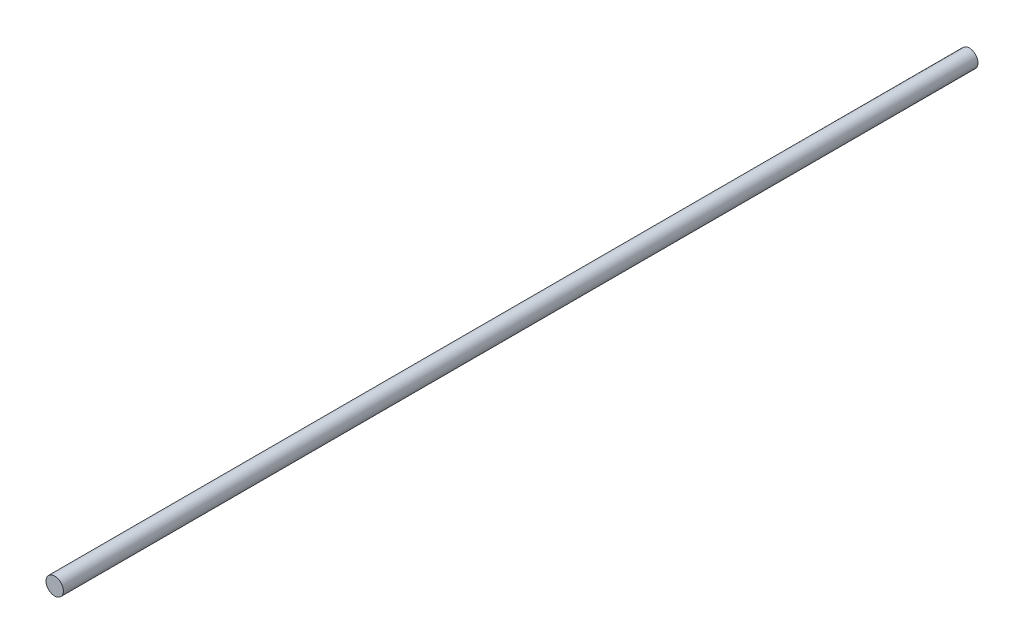
ISO-10303-21;
HEADER;
FILE_DESCRIPTION(('STEP AP214'),'2;1');
FILE_NAME('part.step','',(''),(''),'','','');
FILE_SCHEMA(('AUTOMOTIVE_DESIGN { 1 0 10303 214 1 1 1 1 }'));
ENDSEC;
DATA;
#1=APPLICATION_CONTEXT('core data for automotive mechanical design processes');
#2=APPLICATION_PROTOCOL_DEFINITION('international standard','automotive_design',2000,#1);
#3=PRODUCT_CONTEXT('',#1,'mechanical');
#4=PRODUCT('Part','Part','',(#3));
#5=PRODUCT_RELATED_PRODUCT_CATEGORY('part','',(#4));
#6=PRODUCT_DEFINITION_FORMATION('','',#4);
#7=PRODUCT_DEFINITION_CONTEXT('part definition',#1,'design');
#8=PRODUCT_DEFINITION('design','',#6,#7);
#9=PRODUCT_DEFINITION_SHAPE('','',#8);
#10=(LENGTH_UNIT() NAMED_UNIT(*) SI_UNIT(.MILLI.,.METRE.));
#11=(NAMED_UNIT(*) PLANE_ANGLE_UNIT() SI_UNIT($,.RADIAN.));
#12=(NAMED_UNIT(*) SI_UNIT($,.STERADIAN.) SOLID_ANGLE_UNIT());
#13=UNCERTAINTY_MEASURE_WITH_UNIT(LENGTH_MEASURE(1.E-05),#10,'distance_accuracy_value','');
#14=(GEOMETRIC_REPRESENTATION_CONTEXT(3) GLOBAL_UNCERTAINTY_ASSIGNED_CONTEXT((#13)) GLOBAL_UNIT_ASSIGNED_CONTEXT((#10,
#11,#12)) REPRESENTATION_CONTEXT('',''));
#15=CARTESIAN_POINT('',(0.,0.,0.));
#16=DIRECTION('',(0.,0.,1.));
#17=DIRECTION('',(1.,0.,0.));
#18=AXIS2_PLACEMENT_3D('',#15,#16,#17);
#19=CARTESIAN_POINT('',(0.,0.,200.));
#20=DIRECTION('',(0.,0.,-1.));
#21=DIRECTION('',(-1.,0.,0.));
#22=AXIS2_PLACEMENT_3D('',#19,#20,#21);
#23=CYLINDRICAL_SURFACE('',#22,1.9);
#24=CARTESIAN_POINT('',(0.,0.,200.));
#25=DIRECTION('',(0.,0.,1.));
#26=DIRECTION('',(1.,0.,0.));
#27=AXIS2_PLACEMENT_3D('',#24,#25,#26);
#28=CIRCLE('',#27,1.9);
#29=CARTESIAN_POINT('',(1.9,0.,200.));
#30=VERTEX_POINT('',#29);
#31=EDGE_CURVE('E10',#30,#30,#28,.T.);
#32=ORIENTED_EDGE('',*,*,#31,.F.);
#33=EDGE_LOOP('',(#32));
#34=FACE_BOUND('',#33,.T.);
#35=CARTESIAN_POINT('',(0.,0.,0.));
#36=DIRECTION('',(0.,0.,1.));
#37=DIRECTION('',(1.,0.,0.));
#38=AXIS2_PLACEMENT_3D('',#35,#36,#37);
#39=CIRCLE('',#38,1.9);
#40=CARTESIAN_POINT('',(1.9,0.,0.));
#41=VERTEX_POINT('',#40);
#42=EDGE_CURVE('E40',#41,#41,#39,.T.);
#43=ORIENTED_EDGE('',*,*,#42,.T.);
#44=EDGE_LOOP('',(#43));
#45=FACE_BOUND('',#44,.T.);
#46=ADVANCED_FACE('F37',(#34,#45),#23,.T.);
#47=CARTESIAN_POINT('',(0.,0.,200.));
#48=DIRECTION('',(0.,0.,1.));
#49=DIRECTION('',(1.,0.,0.));
#50=AXIS2_PLACEMENT_3D('',#47,#48,#49);
#51=PLANE('',#50);
#52=ORIENTED_EDGE('',*,*,#31,.T.);
#53=EDGE_LOOP('',(#52));
#54=FACE_BOUND('',#53,.T.);
#55=ADVANCED_FACE('F54',(#54),#51,.T.);
#56=CARTESIAN_POINT('',(0.,0.,0.));
#57=DIRECTION('',(0.,0.,1.));
#58=DIRECTION('',(1.,0.,0.));
#59=AXIS2_PLACEMENT_3D('',#56,#57,#58);
#60=PLANE('',#59);
#61=ORIENTED_EDGE('',*,*,#42,.F.);
#62=EDGE_LOOP('',(#61));
#63=FACE_BOUND('',#62,.T.);
#64=ADVANCED_FACE('F52',(#63),#60,.F.);
#65=CLOSED_SHELL('',(#46,#55,#64));
#66=MANIFOLD_SOLID_BREP('B2',#65);
#67=ADVANCED_BREP_SHAPE_REPRESENTATION('',(#18,#66),#14);
#68=SHAPE_DEFINITION_REPRESENTATION(#9,#67);
ENDSEC;
END-ISO-10303-21;
